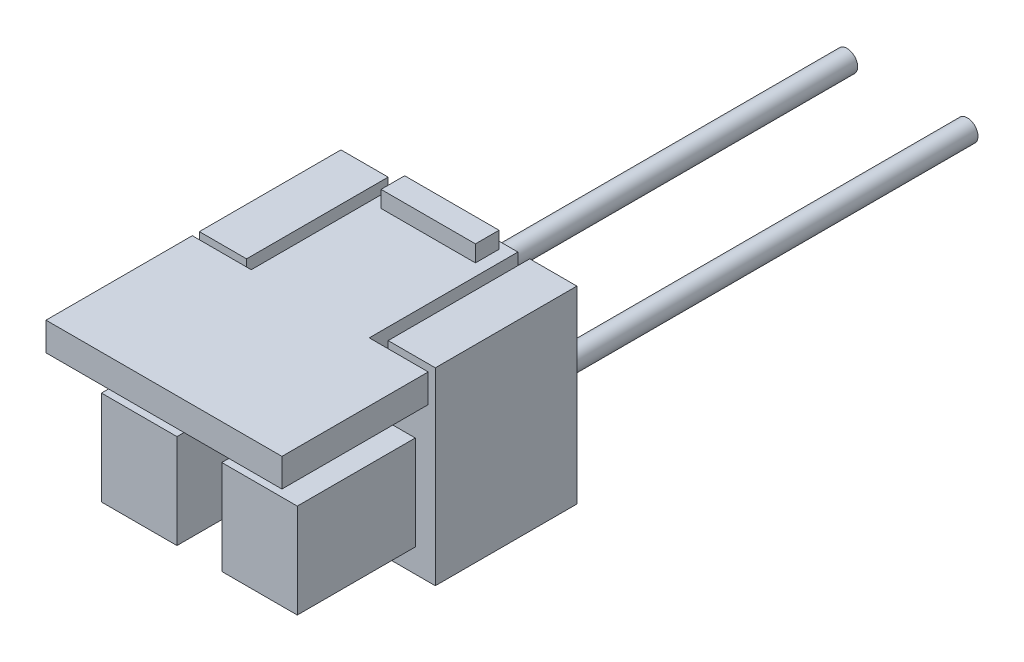
ISO-10303-21;
HEADER;
FILE_DESCRIPTION(('STEP AP214'),'2;1');
FILE_NAME('part.step','',(''),(''),'','','');
FILE_SCHEMA(('AUTOMOTIVE_DESIGN { 1 0 10303 214 1 1 1 1 }'));
ENDSEC;
DATA;
#1=APPLICATION_CONTEXT('core data for automotive mechanical design processes');
#2=APPLICATION_PROTOCOL_DEFINITION('international standard','automotive_design',2000,#1);
#3=PRODUCT_CONTEXT('',#1,'mechanical');
#4=PRODUCT('Part','Part','',(#3));
#5=PRODUCT_RELATED_PRODUCT_CATEGORY('part','',(#4));
#6=PRODUCT_DEFINITION_FORMATION('','',#4);
#7=PRODUCT_DEFINITION_CONTEXT('part definition',#1,'design');
#8=PRODUCT_DEFINITION('design','',#6,#7);
#9=PRODUCT_DEFINITION_SHAPE('','',#8);
#10=(LENGTH_UNIT() NAMED_UNIT(*) SI_UNIT(.MILLI.,.METRE.));
#11=(NAMED_UNIT(*) PLANE_ANGLE_UNIT() SI_UNIT($,.RADIAN.));
#12=(NAMED_UNIT(*) SI_UNIT($,.STERADIAN.) SOLID_ANGLE_UNIT());
#13=UNCERTAINTY_MEASURE_WITH_UNIT(LENGTH_MEASURE(1.E-05),#10,'distance_accuracy_value','');
#14=(GEOMETRIC_REPRESENTATION_CONTEXT(3) GLOBAL_UNCERTAINTY_ASSIGNED_CONTEXT((#13)) GLOBAL_UNIT_ASSIGNED_CONTEXT((#10,
#11,#12)) REPRESENTATION_CONTEXT('',''));
#15=CARTESIAN_POINT('',(0.,0.,0.));
#16=DIRECTION('',(0.,0.,1.));
#17=DIRECTION('',(1.,0.,0.));
#18=AXIS2_PLACEMENT_3D('',#15,#16,#17);
#19=CARTESIAN_POINT('',(5.,5.,-6.));
#20=DIRECTION('',(1.,0.,0.));
#21=DIRECTION('',(0.,0.,-1.));
#22=AXIS2_PLACEMENT_3D('',#19,#20,#21);
#23=PLANE('',#22);
#24=DIRECTION('',(0.,0.,1.));
#25=VECTOR('',#24,1.);
#26=CARTESIAN_POINT('',(5.,5.,-6.));
#27=LINE('',#26,#25);
#28=CARTESIAN_POINT('',(5.,5.,-6.));
#29=VERTEX_POINT('',#28);
#30=CARTESIAN_POINT('',(5.,5.,0.));
#31=VERTEX_POINT('',#30);
#32=EDGE_CURVE('E26',#29,#31,#27,.T.);
#33=ORIENTED_EDGE('',*,*,#32,.T.);
#34=DIRECTION('',(0.,1.,0.));
#35=VECTOR('',#34,1.);
#36=CARTESIAN_POINT('',(5.,5.,0.));
#37=LINE('',#36,#35);
#38=CARTESIAN_POINT('',(5.,-3.,0.));
#39=VERTEX_POINT('',#38);
#40=EDGE_CURVE('E428',#39,#31,#37,.T.);
#41=ORIENTED_EDGE('',*,*,#40,.F.);
#42=DIRECTION('',(0.,0.,1.));
#43=VECTOR('',#42,1.);
#44=CARTESIAN_POINT('',(5.,-3.,-6.));
#45=LINE('',#44,#43);
#46=CARTESIAN_POINT('',(5.,-3.,-6.));
#47=VERTEX_POINT('',#46);
#48=EDGE_CURVE('E11',#47,#39,#45,.T.);
#49=ORIENTED_EDGE('',*,*,#48,.F.);
#50=DIRECTION('',(0.,1.,0.));
#51=VECTOR('',#50,1.);
#52=CARTESIAN_POINT('',(5.,5.,-6.));
#53=LINE('',#52,#51);
#54=EDGE_CURVE('E440',#47,#29,#53,.T.);
#55=ORIENTED_EDGE('',*,*,#54,.T.);
#56=EDGE_LOOP('',(#33,#41,#49,#55));
#57=FACE_BOUND('',#56,.T.);
#58=ADVANCED_FACE('F16',(#57),#23,.T.);
#59=CARTESIAN_POINT('',(0.,5.,-6.));
#60=DIRECTION('',(0.,1.,0.));
#61=DIRECTION('',(0.,0.,1.));
#62=AXIS2_PLACEMENT_3D('',#59,#60,#61);
#63=PLANE('',#62);
#64=DIRECTION('',(0.,0.,-1.));
#65=VECTOR('',#64,1.);
#66=CARTESIAN_POINT('',(3.,5.,-6.));
#67=LINE('',#66,#65);
#68=CARTESIAN_POINT('',(3.,5.,0.));
#69=VERTEX_POINT('',#68);
#70=CARTESIAN_POINT('',(3.,5.,-6.));
#71=VERTEX_POINT('',#70);
#72=EDGE_CURVE('E325',#69,#71,#67,.T.);
#73=ORIENTED_EDGE('',*,*,#72,.F.);
#74=DIRECTION('',(-1.,0.,0.));
#75=VECTOR('',#74,1.);
#76=CARTESIAN_POINT('',(3.,5.,0.));
#77=LINE('',#76,#75);
#78=EDGE_CURVE('E332',#31,#69,#77,.T.);
#79=ORIENTED_EDGE('',*,*,#78,.F.);
#80=ORIENTED_EDGE('',*,*,#32,.F.);
#81=DIRECTION('',(-1.,0.,0.));
#82=VECTOR('',#81,1.);
#83=CARTESIAN_POINT('',(0.,5.,-6.));
#84=LINE('',#83,#82);
#85=EDGE_CURVE('E425',#29,#71,#84,.T.);
#86=ORIENTED_EDGE('',*,*,#85,.T.);
#87=EDGE_LOOP('',(#73,#79,#80,#86));
#88=FACE_BOUND('',#87,.T.);
#89=ADVANCED_FACE('F387',(#88),#63,.T.);
#90=CARTESIAN_POINT('',(5.,-3.,0.));
#91=DIRECTION('',(0.,0.,1.));
#92=DIRECTION('',(1.,0.,0.));
#93=AXIS2_PLACEMENT_3D('',#90,#91,#92);
#94=PLANE('',#93);
#95=DIRECTION('',(1.,0.,0.));
#96=VECTOR('',#95,1.);
#97=CARTESIAN_POINT('',(0.,3.8,0.));
#98=LINE('',#97,#96);
#99=CARTESIAN_POINT('',(-2.5,3.8,0.));
#100=VERTEX_POINT('',#99);
#101=CARTESIAN_POINT('',(2.5,3.8,0.));
#102=VERTEX_POINT('',#101);
#103=EDGE_CURVE('E432',#100,#102,#98,.T.);
#104=ORIENTED_EDGE('',*,*,#103,.F.);
#105=DIRECTION('',(-1.,0.,0.));
#106=VECTOR('',#105,1.);
#107=CARTESIAN_POINT('',(0.,3.8,0.));
#108=LINE('',#107,#106);
#109=CARTESIAN_POINT('',(-3.,3.8,0.));
#110=VERTEX_POINT('',#109);
#111=EDGE_CURVE('E306',#100,#110,#108,.T.);
#112=ORIENTED_EDGE('',*,*,#111,.T.);
#113=DIRECTION('',(0.,1.,0.));
#114=VECTOR('',#113,1.);
#115=CARTESIAN_POINT('',(-3.,-2.97790528113222,0.));
#116=LINE('',#115,#114);
#117=CARTESIAN_POINT('',(-3.,5.,0.));
#118=VERTEX_POINT('',#117);
#119=EDGE_CURVE('E247',#110,#118,#116,.T.);
#120=ORIENTED_EDGE('',*,*,#119,.T.);
#121=DIRECTION('',(1.,0.,0.));
#122=VECTOR('',#121,1.);
#123=CARTESIAN_POINT('',(-3.,5.,0.));
#124=LINE('',#123,#122);
#125=CARTESIAN_POINT('',(-5.,5.,0.));
#126=VERTEX_POINT('',#125);
#127=EDGE_CURVE('E221',#126,#118,#124,.T.);
#128=ORIENTED_EDGE('',*,*,#127,.F.);
#129=DIRECTION('',(0.,1.,0.));
#130=VECTOR('',#129,1.);
#131=CARTESIAN_POINT('',(-5.,5.,0.));
#132=LINE('',#131,#130);
#133=CARTESIAN_POINT('',(-5.,-3.,0.));
#134=VERTEX_POINT('',#133);
#135=EDGE_CURVE('E513',#134,#126,#132,.T.);
#136=ORIENTED_EDGE('',*,*,#135,.F.);
#137=DIRECTION('',(1.,0.,0.));
#138=VECTOR('',#137,1.);
#139=CARTESIAN_POINT('',(0.,-3.,0.));
#140=LINE('',#139,#138);
#141=EDGE_CURVE('E431',#134,#39,#140,.T.);
#142=ORIENTED_EDGE('',*,*,#141,.T.);
#143=ORIENTED_EDGE('',*,*,#40,.T.);
#144=ORIENTED_EDGE('',*,*,#78,.T.);
#145=DIRECTION('',(0.,1.,0.));
#146=VECTOR('',#145,1.);
#147=CARTESIAN_POINT('',(3.,-2.97790528113222,0.));
#148=LINE('',#147,#146);
#149=CARTESIAN_POINT('',(3.,3.8,0.));
#150=VERTEX_POINT('',#149);
#151=EDGE_CURVE('E336',#150,#69,#148,.T.);
#152=ORIENTED_EDGE('',*,*,#151,.F.);
#153=EDGE_CURVE('E20',#102,#150,#98,.T.);
#154=ORIENTED_EDGE('',*,*,#153,.F.);
#155=EDGE_LOOP('',(#104,#112,#120,#128,#136,#142,#143,#144,#152,#154));
#156=FACE_BOUND('',#155,.T.);
#157=DIRECTION('',(1.,0.,0.));
#158=VECTOR('',#157,1.);
#159=CARTESIAN_POINT('',(0.950000000000001,-2.,0.));
#160=LINE('',#159,#158);
#161=CARTESIAN_POINT('',(0.950000000000001,-2.,0.));
#162=VERTEX_POINT('',#161);
#163=CARTESIAN_POINT('',(4.15,-2.,0.));
#164=VERTEX_POINT('',#163);
#165=EDGE_CURVE('E865',#162,#164,#160,.T.);
#166=ORIENTED_EDGE('',*,*,#165,.F.);
#167=DIRECTION('',(0.,-1.,0.));
#168=VECTOR('',#167,1.);
#169=CARTESIAN_POINT('',(0.95,2.,0.));
#170=LINE('',#169,#168);
#171=CARTESIAN_POINT('',(0.95,2.,0.));
#172=VERTEX_POINT('',#171);
#173=EDGE_CURVE('E859',#172,#162,#170,.T.);
#174=ORIENTED_EDGE('',*,*,#173,.F.);
#175=DIRECTION('',(-1.,0.,0.));
#176=VECTOR('',#175,1.);
#177=CARTESIAN_POINT('',(0.95,2.,0.));
#178=LINE('',#177,#176);
#179=CARTESIAN_POINT('',(4.15,2.,0.));
#180=VERTEX_POINT('',#179);
#181=EDGE_CURVE('E870',#180,#172,#178,.T.);
#182=ORIENTED_EDGE('',*,*,#181,.F.);
#183=DIRECTION('',(0.,1.,0.));
#184=VECTOR('',#183,1.);
#185=CARTESIAN_POINT('',(4.15,2.,0.));
#186=LINE('',#185,#184);
#187=EDGE_CURVE('E867',#164,#180,#186,.T.);
#188=ORIENTED_EDGE('',*,*,#187,.F.);
#189=EDGE_LOOP('',(#166,#174,#182,#188));
#190=FACE_BOUND('',#189,.T.);
#191=DIRECTION('',(-1.,0.,0.));
#192=VECTOR('',#191,1.);
#193=CARTESIAN_POINT('',(-0.950000000000001,-2.,0.));
#194=LINE('',#193,#192);
#195=CARTESIAN_POINT('',(-0.950000000000001,-2.,0.));
#196=VERTEX_POINT('',#195);
#197=CARTESIAN_POINT('',(-4.15,-2.,0.));
#198=VERTEX_POINT('',#197);
#199=EDGE_CURVE('E278',#196,#198,#194,.T.);
#200=ORIENTED_EDGE('',*,*,#199,.T.);
#201=DIRECTION('',(0.,1.,0.));
#202=VECTOR('',#201,1.);
#203=CARTESIAN_POINT('',(-4.15,2.,0.));
#204=LINE('',#203,#202);
#205=CARTESIAN_POINT('',(-4.15,2.,0.));
#206=VERTEX_POINT('',#205);
#207=EDGE_CURVE('E281',#198,#206,#204,.T.);
#208=ORIENTED_EDGE('',*,*,#207,.T.);
#209=DIRECTION('',(1.,0.,0.));
#210=VECTOR('',#209,1.);
#211=CARTESIAN_POINT('',(-0.95,2.,0.));
#212=LINE('',#211,#210);
#213=CARTESIAN_POINT('',(-0.95,2.,0.));
#214=VERTEX_POINT('',#213);
#215=EDGE_CURVE('E284',#206,#214,#212,.T.);
#216=ORIENTED_EDGE('',*,*,#215,.T.);
#217=DIRECTION('',(0.,-1.,0.));
#218=VECTOR('',#217,1.);
#219=CARTESIAN_POINT('',(-0.95,2.,0.));
#220=LINE('',#219,#218);
#221=EDGE_CURVE('E275',#214,#196,#220,.T.);
#222=ORIENTED_EDGE('',*,*,#221,.T.);
#223=EDGE_LOOP('',(#200,#208,#216,#222));
#224=FACE_BOUND('',#223,.T.);
#225=ADVANCED_FACE('F392',(#156,#190,#224),#94,.T.);
#226=DIRECTION('',(0.,1.,0.));
#227=VECTOR('',#226,1.);
#228=CARTESIAN_POINT('',(5.,-2.97790528113222,0.300000000000002));
#229=LINE('',#228,#227);
#230=CARTESIAN_POINT('',(5.,3.8,0.300000000000002));
#231=VERTEX_POINT('',#230);
#232=CARTESIAN_POINT('',(5.,5.,0.300000000000002));
#233=VERTEX_POINT('',#232);
#234=EDGE_CURVE('E338',#231,#233,#229,.T.);
#235=ORIENTED_EDGE('',*,*,#234,.T.);
#236=CARTESIAN_POINT('',(4.99999999999999,5.,6.5));
#237=VERTEX_POINT('',#236);
#238=EDGE_CURVE('E410',#233,#237,#27,.T.);
#239=ORIENTED_EDGE('',*,*,#238,.T.);
#240=DIRECTION('',(0.,1.,0.));
#241=VECTOR('',#240,1.);
#242=CARTESIAN_POINT('',(4.99999999999999,3.8,6.5));
#243=LINE('',#242,#241);
#244=CARTESIAN_POINT('',(4.99999999999999,3.8,6.5));
#245=VERTEX_POINT('',#244);
#246=EDGE_CURVE('E477',#245,#237,#243,.T.);
#247=ORIENTED_EDGE('',*,*,#246,.F.);
#248=DIRECTION('',(0.,0.,-1.));
#249=VECTOR('',#248,1.);
#250=CARTESIAN_POINT('',(4.99999999999999,3.8,6.5));
#251=LINE('',#250,#249);
#252=EDGE_CURVE('E413',#245,#231,#251,.T.);
#253=ORIENTED_EDGE('',*,*,#252,.T.);
#254=EDGE_LOOP('',(#235,#239,#247,#253));
#255=FACE_BOUND('',#254,.T.);
#256=ADVANCED_FACE('F18',(#255),#23,.T.);
#257=CARTESIAN_POINT('',(0.,-3.,-6.));
#258=DIRECTION('',(0.,-1.,0.));
#259=DIRECTION('',(0.,0.,-1.));
#260=AXIS2_PLACEMENT_3D('',#257,#258,#259);
#261=PLANE('',#260);
#262=ORIENTED_EDGE('',*,*,#141,.F.);
#263=DIRECTION('',(0.,0.,1.));
#264=VECTOR('',#263,1.);
#265=CARTESIAN_POINT('',(-5.,-3.,-6.));
#266=LINE('',#265,#264);
#267=CARTESIAN_POINT('',(-5.,-3.,-6.));
#268=VERTEX_POINT('',#267);
#269=EDGE_CURVE('E328',#268,#134,#266,.T.);
#270=ORIENTED_EDGE('',*,*,#269,.F.);
#271=DIRECTION('',(1.,0.,0.));
#272=VECTOR('',#271,1.);
#273=CARTESIAN_POINT('',(0.,-3.,-6.));
#274=LINE('',#273,#272);
#275=EDGE_CURVE('E422',#268,#47,#274,.T.);
#276=ORIENTED_EDGE('',*,*,#275,.T.);
#277=ORIENTED_EDGE('',*,*,#48,.T.);
#278=EDGE_LOOP('',(#262,#270,#276,#277));
#279=FACE_BOUND('',#278,.T.);
#280=ADVANCED_FACE('F397',(#279),#261,.T.);
#281=DIRECTION('',(0.,0.,1.));
#282=VECTOR('',#281,1.);
#283=CARTESIAN_POINT('',(-5.,5.,-6.00000000000001));
#284=LINE('',#283,#282);
#285=CARTESIAN_POINT('',(-5.,5.,0.300000000000002));
#286=VERTEX_POINT('',#285);
#287=CARTESIAN_POINT('',(-5.00000000000001,5.,6.5));
#288=VERTEX_POINT('',#287);
#289=EDGE_CURVE('E233',#286,#288,#284,.T.);
#290=ORIENTED_EDGE('',*,*,#289,.T.);
#291=DIRECTION('',(-1.,0.,0.));
#292=VECTOR('',#291,1.);
#293=CARTESIAN_POINT('',(4.99999999999999,5.,6.5));
#294=LINE('',#293,#292);
#295=EDGE_CURVE('E420',#237,#288,#294,.T.);
#296=ORIENTED_EDGE('',*,*,#295,.F.);
#297=ORIENTED_EDGE('',*,*,#238,.F.);
#298=DIRECTION('',(1.,0.,0.));
#299=VECTOR('',#298,1.);
#300=CARTESIAN_POINT('',(5.,5.,0.300000000000002));
#301=LINE('',#300,#299);
#302=CARTESIAN_POINT('',(2.5,5.,0.300000000000002));
#303=VERTEX_POINT('',#302);
#304=EDGE_CURVE('E330',#303,#233,#301,.T.);
#305=ORIENTED_EDGE('',*,*,#304,.F.);
#306=DIRECTION('',(0.,0.,1.));
#307=VECTOR('',#306,1.);
#308=CARTESIAN_POINT('',(2.5,5.,0.300000000000002));
#309=LINE('',#308,#307);
#310=CARTESIAN_POINT('',(2.5,5.,-6.));
#311=VERTEX_POINT('',#310);
#312=EDGE_CURVE('E327',#311,#303,#309,.T.);
#313=ORIENTED_EDGE('',*,*,#312,.F.);
#314=CARTESIAN_POINT('',(-2.5,5.,-6.));
#315=VERTEX_POINT('',#314);
#316=EDGE_CURVE('E443',#311,#315,#84,.T.);
#317=ORIENTED_EDGE('',*,*,#316,.T.);
#318=DIRECTION('',(0.,0.,1.));
#319=VECTOR('',#318,1.);
#320=CARTESIAN_POINT('',(-2.5,5.,0.300000000000002));
#321=LINE('',#320,#319);
#322=CARTESIAN_POINT('',(-2.5,5.,0.300000000000002));
#323=VERTEX_POINT('',#322);
#324=EDGE_CURVE('E237',#315,#323,#321,.T.);
#325=ORIENTED_EDGE('',*,*,#324,.T.);
#326=DIRECTION('',(-1.,0.,0.));
#327=VECTOR('',#326,1.);
#328=CARTESIAN_POINT('',(-5.,5.,0.300000000000002));
#329=LINE('',#328,#327);
#330=EDGE_CURVE('E240',#323,#286,#329,.T.);
#331=ORIENTED_EDGE('',*,*,#330,.T.);
#332=EDGE_LOOP('',(#290,#296,#297,#305,#313,#317,#325,#331));
#333=FACE_BOUND('',#332,.T.);
#334=DIRECTION('',(1.,0.,0.));
#335=VECTOR('',#334,1.);
#336=CARTESIAN_POINT('',(2.,5.,-4.7));
#337=LINE('',#336,#335);
#338=CARTESIAN_POINT('',(-2.,5.,-4.7));
#339=VERTEX_POINT('',#338);
#340=CARTESIAN_POINT('',(2.,5.,-4.7));
#341=VERTEX_POINT('',#340);
#342=EDGE_CURVE('E360',#339,#341,#337,.T.);
#343=ORIENTED_EDGE('',*,*,#342,.F.);
#344=DIRECTION('',(0.,0.,-1.));
#345=VECTOR('',#344,1.);
#346=CARTESIAN_POINT('',(-2.,5.,-5.7));
#347=LINE('',#346,#345);
#348=CARTESIAN_POINT('',(-2.,5.,-5.7));
#349=VERTEX_POINT('',#348);
#350=EDGE_CURVE('E263',#339,#349,#347,.T.);
#351=ORIENTED_EDGE('',*,*,#350,.T.);
#352=DIRECTION('',(-1.,0.,0.));
#353=VECTOR('',#352,1.);
#354=CARTESIAN_POINT('',(0.,5.,-5.7));
#355=LINE('',#354,#353);
#356=CARTESIAN_POINT('',(2.,5.,-5.7));
#357=VERTEX_POINT('',#356);
#358=EDGE_CURVE('E352',#357,#349,#355,.T.);
#359=ORIENTED_EDGE('',*,*,#358,.F.);
#360=DIRECTION('',(0.,0.,-1.));
#361=VECTOR('',#360,1.);
#362=CARTESIAN_POINT('',(2.,5.,-5.7));
#363=LINE('',#362,#361);
#364=EDGE_CURVE('E42',#341,#357,#363,.T.);
#365=ORIENTED_EDGE('',*,*,#364,.F.);
#366=EDGE_LOOP('',(#343,#351,#359,#365));
#367=FACE_BOUND('',#366,.T.);
#368=ADVANCED_FACE('F394',(#333,#367),#63,.T.);
#369=CARTESIAN_POINT('',(5.,-3.,-6.));
#370=DIRECTION('',(0.,0.,1.));
#371=DIRECTION('',(1.,0.,0.));
#372=AXIS2_PLACEMENT_3D('',#369,#370,#371);
#373=PLANE('',#372);
#374=CARTESIAN_POINT('',(2.55,0.,-6.));
#375=DIRECTION('',(0.,0.,1.));
#376=DIRECTION('',(1.,0.,0.));
#377=AXIS2_PLACEMENT_3D('',#374,#375,#376);
#378=CIRCLE('',#377,0.45);
#379=CARTESIAN_POINT('',(3.,0.,-6.));
#380=VERTEX_POINT('',#379);
#381=EDGE_CURVE('E350',#380,#380,#378,.T.);
#382=ORIENTED_EDGE('',*,*,#381,.T.);
#383=EDGE_LOOP('',(#382));
#384=FACE_BOUND('',#383,.T.);
#385=DIRECTION('',(1.,0.,0.));
#386=VECTOR('',#385,1.);
#387=CARTESIAN_POINT('',(3.,3.8,-6.));
#388=LINE('',#387,#386);
#389=CARTESIAN_POINT('',(2.5,3.8,-6.));
#390=VERTEX_POINT('',#389);
#391=CARTESIAN_POINT('',(3.,3.8,-6.));
#392=VERTEX_POINT('',#391);
#393=EDGE_CURVE('E324',#390,#392,#388,.T.);
#394=ORIENTED_EDGE('',*,*,#393,.T.);
#395=DIRECTION('',(0.,1.,0.));
#396=VECTOR('',#395,1.);
#397=CARTESIAN_POINT('',(3.,-2.97790528113222,-6.));
#398=LINE('',#397,#396);
#399=EDGE_CURVE('E335',#392,#71,#398,.T.);
#400=ORIENTED_EDGE('',*,*,#399,.T.);
#401=ORIENTED_EDGE('',*,*,#85,.F.);
#402=ORIENTED_EDGE('',*,*,#54,.F.);
#403=ORIENTED_EDGE('',*,*,#275,.F.);
#404=DIRECTION('',(0.,1.,0.));
#405=VECTOR('',#404,1.);
#406=CARTESIAN_POINT('',(-5.,5.,-6.00000000000001));
#407=LINE('',#406,#405);
#408=CARTESIAN_POINT('',(-5.,5.,-6.00000000000001));
#409=VERTEX_POINT('',#408);
#410=EDGE_CURVE('E229',#268,#409,#407,.T.);
#411=ORIENTED_EDGE('',*,*,#410,.T.);
#412=DIRECTION('',(1.,0.,0.));
#413=VECTOR('',#412,1.);
#414=CARTESIAN_POINT('',(0.,5.,-6.));
#415=LINE('',#414,#413);
#416=CARTESIAN_POINT('',(-3.,5.,-6.));
#417=VERTEX_POINT('',#416);
#418=EDGE_CURVE('E224',#409,#417,#415,.T.);
#419=ORIENTED_EDGE('',*,*,#418,.T.);
#420=DIRECTION('',(0.,1.,0.));
#421=VECTOR('',#420,1.);
#422=CARTESIAN_POINT('',(-3.,-2.97790528113222,-6.));
#423=LINE('',#422,#421);
#424=CARTESIAN_POINT('',(-3.,3.8,-6.));
#425=VERTEX_POINT('',#424);
#426=EDGE_CURVE('E210',#425,#417,#423,.T.);
#427=ORIENTED_EDGE('',*,*,#426,.F.);
#428=DIRECTION('',(-1.,0.,0.));
#429=VECTOR('',#428,1.);
#430=CARTESIAN_POINT('',(-3.,3.8,-6.));
#431=LINE('',#430,#429);
#432=CARTESIAN_POINT('',(-2.5,3.8,-6.));
#433=VERTEX_POINT('',#432);
#434=EDGE_CURVE('E257',#433,#425,#431,.T.);
#435=ORIENTED_EDGE('',*,*,#434,.F.);
#436=DIRECTION('',(0.,1.,0.));
#437=VECTOR('',#436,1.);
#438=CARTESIAN_POINT('',(-2.5,-2.97790528113222,-6.));
#439=LINE('',#438,#437);
#440=EDGE_CURVE('E220',#433,#315,#439,.T.);
#441=ORIENTED_EDGE('',*,*,#440,.T.);
#442=ORIENTED_EDGE('',*,*,#316,.F.);
#443=DIRECTION('',(0.,1.,0.));
#444=VECTOR('',#443,1.);
#445=CARTESIAN_POINT('',(2.5,-2.97790528113222,-6.));
#446=LINE('',#445,#444);
#447=EDGE_CURVE('E342',#390,#311,#446,.T.);
#448=ORIENTED_EDGE('',*,*,#447,.F.);
#449=EDGE_LOOP('',(#394,#400,#401,#402,#403,#411,#419,#427,#435,#441,#442,#448));
#450=FACE_BOUND('',#449,.T.);
#451=CARTESIAN_POINT('',(-2.55,0.,-6.));
#452=DIRECTION('',(0.,0.,-1.));
#453=DIRECTION('',(-1.,0.,0.));
#454=AXIS2_PLACEMENT_3D('',#451,#452,#453);
#455=CIRCLE('',#454,0.45);
#456=CARTESIAN_POINT('',(-3.,0.,-6.));
#457=VERTEX_POINT('',#456);
#458=EDGE_CURVE('E262',#457,#457,#455,.T.);
#459=ORIENTED_EDGE('',*,*,#458,.F.);
#460=EDGE_LOOP('',(#459));
#461=FACE_BOUND('',#460,.T.);
#462=ADVANCED_FACE('F226',(#384,#450,#461),#373,.F.);
#463=CARTESIAN_POINT('',(0.,3.8,6.5));
#464=DIRECTION('',(0.,1.,0.));
#465=DIRECTION('',(0.,0.,1.));
#466=AXIS2_PLACEMENT_3D('',#463,#464,#465);
#467=PLANE('',#466);
#468=DIRECTION('',(0.,0.,-1.));
#469=VECTOR('',#468,1.);
#470=CARTESIAN_POINT('',(2.5,3.8,0.300000000000002));
#471=LINE('',#470,#469);
#472=CARTESIAN_POINT('',(2.5,3.8,0.300000000000002));
#473=VERTEX_POINT('',#472);
#474=EDGE_CURVE('E316',#473,#102,#471,.T.);
#475=ORIENTED_EDGE('',*,*,#474,.F.);
#476=DIRECTION('',(-1.,0.,0.));
#477=VECTOR('',#476,1.);
#478=CARTESIAN_POINT('',(5.,3.8,0.300000000000002));
#479=LINE('',#478,#477);
#480=EDGE_CURVE('E318',#231,#473,#479,.T.);
#481=ORIENTED_EDGE('',*,*,#480,.F.);
#482=ORIENTED_EDGE('',*,*,#252,.F.);
#483=DIRECTION('',(1.,0.,0.));
#484=VECTOR('',#483,1.);
#485=CARTESIAN_POINT('',(0.,3.8,6.5));
#486=LINE('',#485,#484);
#487=CARTESIAN_POINT('',(-5.00000000000001,3.8,6.5));
#488=VERTEX_POINT('',#487);
#489=EDGE_CURVE('E436',#488,#245,#486,.T.);
#490=ORIENTED_EDGE('',*,*,#489,.F.);
#491=DIRECTION('',(0.,0.,-1.));
#492=VECTOR('',#491,1.);
#493=CARTESIAN_POINT('',(-5.00000000000001,3.8,6.5));
#494=LINE('',#493,#492);
#495=CARTESIAN_POINT('',(-5.,3.8,0.300000000000002));
#496=VERTEX_POINT('',#495);
#497=EDGE_CURVE('E469',#488,#496,#494,.T.);
#498=ORIENTED_EDGE('',*,*,#497,.T.);
#499=DIRECTION('',(1.,0.,0.));
#500=VECTOR('',#499,1.);
#501=CARTESIAN_POINT('',(-5.,3.8,0.300000000000002));
#502=LINE('',#501,#500);
#503=CARTESIAN_POINT('',(-2.5,3.8,0.300000000000002));
#504=VERTEX_POINT('',#503);
#505=EDGE_CURVE('E461',#496,#504,#502,.T.);
#506=ORIENTED_EDGE('',*,*,#505,.T.);
#507=DIRECTION('',(0.,0.,-1.));
#508=VECTOR('',#507,1.);
#509=CARTESIAN_POINT('',(-2.5,3.8,0.300000000000002));
#510=LINE('',#509,#508);
#511=EDGE_CURVE('E457',#504,#100,#510,.T.);
#512=ORIENTED_EDGE('',*,*,#511,.T.);
#513=ORIENTED_EDGE('',*,*,#103,.T.);
#514=EDGE_LOOP('',(#475,#481,#482,#490,#498,#506,#512,#513));
#515=FACE_BOUND('',#514,.T.);
#516=ADVANCED_FACE('F465',(#515),#467,.F.);
#517=CARTESIAN_POINT('',(4.99999999999999,5.,6.5));
#518=DIRECTION('',(0.,0.,1.));
#519=DIRECTION('',(1.,0.,0.));
#520=AXIS2_PLACEMENT_3D('',#517,#518,#519);
#521=PLANE('',#520);
#522=ORIENTED_EDGE('',*,*,#246,.T.);
#523=ORIENTED_EDGE('',*,*,#295,.T.);
#524=DIRECTION('',(0.,1.,0.));
#525=VECTOR('',#524,1.);
#526=CARTESIAN_POINT('',(-5.00000000000001,3.8,6.5));
#527=LINE('',#526,#525);
#528=EDGE_CURVE('E309',#488,#288,#527,.T.);
#529=ORIENTED_EDGE('',*,*,#528,.F.);
#530=ORIENTED_EDGE('',*,*,#489,.T.);
#531=EDGE_LOOP('',(#522,#523,#529,#530));
#532=FACE_BOUND('',#531,.T.);
#533=ADVANCED_FACE('F494',(#532),#521,.T.);
#534=CARTESIAN_POINT('',(0.95,2.,5.));
#535=DIRECTION('',(1.,0.,0.));
#536=DIRECTION('',(0.,1.,0.));
#537=AXIS2_PLACEMENT_3D('',#534,#535,#536);
#538=PLANE('',#537);
#539=ORIENTED_EDGE('',*,*,#173,.T.);
#540=DIRECTION('',(0.,0.,-1.));
#541=VECTOR('',#540,1.);
#542=CARTESIAN_POINT('',(0.950000000000001,-2.,5.));
#543=LINE('',#542,#541);
#544=CARTESIAN_POINT('',(0.950000000000001,-2.,5.));
#545=VERTEX_POINT('',#544);
#546=EDGE_CURVE('E479',#545,#162,#543,.T.);
#547=ORIENTED_EDGE('',*,*,#546,.F.);
#548=DIRECTION('',(0.,-1.,0.));
#549=VECTOR('',#548,1.);
#550=CARTESIAN_POINT('',(0.95,2.,5.));
#551=LINE('',#550,#549);
#552=CARTESIAN_POINT('',(0.95,2.,5.));
#553=VERTEX_POINT('',#552);
#554=EDGE_CURVE('E872',#553,#545,#551,.T.);
#555=ORIENTED_EDGE('',*,*,#554,.F.);
#556=DIRECTION('',(0.,0.,-1.));
#557=VECTOR('',#556,1.);
#558=CARTESIAN_POINT('',(0.95,2.,5.));
#559=LINE('',#558,#557);
#560=EDGE_CURVE('E881',#553,#172,#559,.T.);
#561=ORIENTED_EDGE('',*,*,#560,.T.);
#562=EDGE_LOOP('',(#539,#547,#555,#561));
#563=FACE_BOUND('',#562,.T.);
#564=ADVANCED_FACE('F723',(#563),#538,.F.);
#565=CARTESIAN_POINT('',(0.950000000000001,-2.,5.));
#566=DIRECTION('',(0.,1.,0.));
#567=DIRECTION('',(-1.,0.,0.));
#568=AXIS2_PLACEMENT_3D('',#565,#566,#567);
#569=PLANE('',#568);
#570=ORIENTED_EDGE('',*,*,#165,.T.);
#571=DIRECTION('',(0.,0.,-1.));
#572=VECTOR('',#571,1.);
#573=CARTESIAN_POINT('',(4.15,-2.,5.));
#574=LINE('',#573,#572);
#575=CARTESIAN_POINT('',(4.15,-2.,5.));
#576=VERTEX_POINT('',#575);
#577=EDGE_CURVE('E481',#576,#164,#574,.T.);
#578=ORIENTED_EDGE('',*,*,#577,.F.);
#579=DIRECTION('',(1.,0.,0.));
#580=VECTOR('',#579,1.);
#581=CARTESIAN_POINT('',(0.950000000000001,-2.,5.));
#582=LINE('',#581,#580);
#583=EDGE_CURVE('E875',#545,#576,#582,.T.);
#584=ORIENTED_EDGE('',*,*,#583,.F.);
#585=ORIENTED_EDGE('',*,*,#546,.T.);
#586=EDGE_LOOP('',(#570,#578,#584,#585));
#587=FACE_BOUND('',#586,.T.);
#588=ADVANCED_FACE('F731',(#587),#569,.F.);
#589=CARTESIAN_POINT('',(4.15,2.,5.));
#590=DIRECTION('',(-1.,0.,0.));
#591=DIRECTION('',(0.,-1.,0.));
#592=AXIS2_PLACEMENT_3D('',#589,#590,#591);
#593=PLANE('',#592);
#594=ORIENTED_EDGE('',*,*,#187,.T.);
#595=DIRECTION('',(0.,0.,-1.));
#596=VECTOR('',#595,1.);
#597=CARTESIAN_POINT('',(4.15,2.,5.));
#598=LINE('',#597,#596);
#599=CARTESIAN_POINT('',(4.15,2.,5.));
#600=VERTEX_POINT('',#599);
#601=EDGE_CURVE('E487',#600,#180,#598,.T.);
#602=ORIENTED_EDGE('',*,*,#601,.F.);
#603=DIRECTION('',(0.,1.,0.));
#604=VECTOR('',#603,1.);
#605=CARTESIAN_POINT('',(4.15,2.,5.));
#606=LINE('',#605,#604);
#607=EDGE_CURVE('E877',#576,#600,#606,.T.);
#608=ORIENTED_EDGE('',*,*,#607,.F.);
#609=ORIENTED_EDGE('',*,*,#577,.T.);
#610=EDGE_LOOP('',(#594,#602,#608,#609));
#611=FACE_BOUND('',#610,.T.);
#612=ADVANCED_FACE('F740',(#611),#593,.F.);
#613=CARTESIAN_POINT('',(0.95,2.,5.));
#614=DIRECTION('',(0.,-1.,0.));
#615=DIRECTION('',(0.,0.,-1.));
#616=AXIS2_PLACEMENT_3D('',#613,#614,#615);
#617=PLANE('',#616);
#618=ORIENTED_EDGE('',*,*,#181,.T.);
#619=ORIENTED_EDGE('',*,*,#560,.F.);
#620=DIRECTION('',(-1.,0.,0.));
#621=VECTOR('',#620,1.);
#622=CARTESIAN_POINT('',(0.95,2.,5.));
#623=LINE('',#622,#621);
#624=EDGE_CURVE('E879',#600,#553,#623,.T.);
#625=ORIENTED_EDGE('',*,*,#624,.F.);
#626=ORIENTED_EDGE('',*,*,#601,.T.);
#627=EDGE_LOOP('',(#618,#619,#625,#626));
#628=FACE_BOUND('',#627,.T.);
#629=ADVANCED_FACE('F748',(#628),#617,.F.);
#630=CARTESIAN_POINT('',(0.95,2.,5.));
#631=DIRECTION('',(0.,0.,1.));
#632=DIRECTION('',(1.,0.,0.));
#633=AXIS2_PLACEMENT_3D('',#630,#631,#632);
#634=PLANE('',#633);
#635=ORIENTED_EDGE('',*,*,#554,.T.);
#636=ORIENTED_EDGE('',*,*,#583,.T.);
#637=ORIENTED_EDGE('',*,*,#607,.T.);
#638=ORIENTED_EDGE('',*,*,#624,.T.);
#639=EDGE_LOOP('',(#635,#636,#637,#638));
#640=FACE_BOUND('',#639,.T.);
#641=ADVANCED_FACE('F757',(#640),#634,.T.);
#642=CARTESIAN_POINT('',(2.,5.7,-5.7));
#643=DIRECTION('',(-1.,0.,0.));
#644=DIRECTION('',(0.,0.,1.));
#645=AXIS2_PLACEMENT_3D('',#642,#643,#644);
#646=PLANE('',#645);
#647=ORIENTED_EDGE('',*,*,#364,.T.);
#648=DIRECTION('',(0.,-1.,0.));
#649=VECTOR('',#648,1.);
#650=CARTESIAN_POINT('',(2.,5.7,-5.7));
#651=LINE('',#650,#649);
#652=CARTESIAN_POINT('',(2.,5.7,-5.7));
#653=VERTEX_POINT('',#652);
#654=EDGE_CURVE('E855',#653,#357,#651,.T.);
#655=ORIENTED_EDGE('',*,*,#654,.F.);
#656=DIRECTION('',(0.,0.,-1.));
#657=VECTOR('',#656,1.);
#658=CARTESIAN_POINT('',(2.,5.7,-5.7));
#659=LINE('',#658,#657);
#660=CARTESIAN_POINT('',(2.,5.7,-4.7));
#661=VERTEX_POINT('',#660);
#662=EDGE_CURVE('E355',#661,#653,#659,.T.);
#663=ORIENTED_EDGE('',*,*,#662,.F.);
#664=DIRECTION('',(0.,-1.,0.));
#665=VECTOR('',#664,1.);
#666=CARTESIAN_POINT('',(2.,5.7,-4.7));
#667=LINE('',#666,#665);
#668=EDGE_CURVE('E849',#661,#341,#667,.T.);
#669=ORIENTED_EDGE('',*,*,#668,.T.);
#670=EDGE_LOOP('',(#647,#655,#663,#669));
#671=FACE_BOUND('',#670,.T.);
#672=ADVANCED_FACE('F766',(#671),#646,.F.);
#673=CARTESIAN_POINT('',(0.,5.7,-5.7));
#674=DIRECTION('',(0.,0.,1.));
#675=DIRECTION('',(1.,0.,0.));
#676=AXIS2_PLACEMENT_3D('',#673,#674,#675);
#677=PLANE('',#676);
#678=ORIENTED_EDGE('',*,*,#358,.T.);
#679=DIRECTION('',(0.,-1.,0.));
#680=VECTOR('',#679,1.);
#681=CARTESIAN_POINT('',(-2.,5.7,-5.7));
#682=LINE('',#681,#680);
#683=CARTESIAN_POINT('',(-2.,5.7,-5.7));
#684=VERTEX_POINT('',#683);
#685=EDGE_CURVE('E272',#684,#349,#682,.T.);
#686=ORIENTED_EDGE('',*,*,#685,.F.);
#687=DIRECTION('',(-1.,0.,0.));
#688=VECTOR('',#687,1.);
#689=CARTESIAN_POINT('',(0.,5.7,-5.7));
#690=LINE('',#689,#688);
#691=EDGE_CURVE('E861',#653,#684,#690,.T.);
#692=ORIENTED_EDGE('',*,*,#691,.F.);
#693=ORIENTED_EDGE('',*,*,#654,.T.);
#694=EDGE_LOOP('',(#678,#686,#692,#693));
#695=FACE_BOUND('',#694,.T.);
#696=ADVANCED_FACE('F775',(#695),#677,.F.);
#697=CARTESIAN_POINT('',(2.,5.7,-4.7));
#698=DIRECTION('',(0.,0.,-1.));
#699=DIRECTION('',(-1.,0.,0.));
#700=AXIS2_PLACEMENT_3D('',#697,#698,#699);
#701=PLANE('',#700);
#702=ORIENTED_EDGE('',*,*,#342,.T.);
#703=ORIENTED_EDGE('',*,*,#668,.F.);
#704=DIRECTION('',(1.,0.,0.));
#705=VECTOR('',#704,1.);
#706=CARTESIAN_POINT('',(2.,5.7,-4.7));
#707=LINE('',#706,#705);
#708=CARTESIAN_POINT('',(-2.,5.7,-4.7));
#709=VERTEX_POINT('',#708);
#710=EDGE_CURVE('E856',#709,#661,#707,.T.);
#711=ORIENTED_EDGE('',*,*,#710,.F.);
#712=DIRECTION('',(0.,-1.,0.));
#713=VECTOR('',#712,1.);
#714=CARTESIAN_POINT('',(-2.,5.7,-4.7));
#715=LINE('',#714,#713);
#716=EDGE_CURVE('E269',#709,#339,#715,.T.);
#717=ORIENTED_EDGE('',*,*,#716,.T.);
#718=EDGE_LOOP('',(#702,#703,#711,#717));
#719=FACE_BOUND('',#718,.T.);
#720=ADVANCED_FACE('F383',(#719),#701,.F.);
#721=CARTESIAN_POINT('',(2.,5.7,-4.7));
#722=DIRECTION('',(0.,-1.,0.));
#723=DIRECTION('',(0.,0.,-1.));
#724=AXIS2_PLACEMENT_3D('',#721,#722,#723);
#725=PLANE('',#724);
#726=ORIENTED_EDGE('',*,*,#662,.T.);
#727=ORIENTED_EDGE('',*,*,#691,.T.);
#728=DIRECTION('',(0.,0.,-1.));
#729=VECTOR('',#728,1.);
#730=CARTESIAN_POINT('',(-2.,5.7,-5.7));
#731=LINE('',#730,#729);
#732=EDGE_CURVE('E266',#709,#684,#731,.T.);
#733=ORIENTED_EDGE('',*,*,#732,.F.);
#734=ORIENTED_EDGE('',*,*,#710,.T.);
#735=EDGE_LOOP('',(#726,#727,#733,#734));
#736=FACE_BOUND('',#735,.T.);
#737=ADVANCED_FACE('F372',(#736),#725,.F.);
#738=CARTESIAN_POINT('',(2.55,0.,-25.));
#739=DIRECTION('',(0.,0.,1.));
#740=DIRECTION('',(1.,0.,0.));
#741=AXIS2_PLACEMENT_3D('',#738,#739,#740);
#742=CYLINDRICAL_SURFACE('',#741,0.45);
#743=CARTESIAN_POINT('',(2.55,0.,-25.));
#744=DIRECTION('',(0.,0.,1.));
#745=DIRECTION('',(-1.,0.,0.));
#746=AXIS2_PLACEMENT_3D('',#743,#744,#745);
#747=CIRCLE('',#746,0.45);
#748=CARTESIAN_POINT('',(2.1,0.,-25.));
#749=VERTEX_POINT('',#748);
#750=EDGE_CURVE('E347',#749,#749,#747,.T.);
#751=ORIENTED_EDGE('',*,*,#750,.T.);
#752=EDGE_LOOP('',(#751));
#753=FACE_BOUND('',#752,.T.);
#754=ORIENTED_EDGE('',*,*,#381,.F.);
#755=EDGE_LOOP('',(#754));
#756=FACE_BOUND('',#755,.T.);
#757=ADVANCED_FACE('F369',(#753,#756),#742,.T.);
#758=CARTESIAN_POINT('',(2.55,0.,-25.));
#759=DIRECTION('',(0.,0.,-1.));
#760=DIRECTION('',(-1.,0.,0.));
#761=AXIS2_PLACEMENT_3D('',#758,#759,#760);
#762=PLANE('',#761);
#763=ORIENTED_EDGE('',*,*,#750,.F.);
#764=EDGE_LOOP('',(#763));
#765=FACE_BOUND('',#764,.T.);
#766=ADVANCED_FACE('F371',(#765),#762,.T.);
#767=CARTESIAN_POINT('',(3.,-2.97790528113222,-6.));
#768=DIRECTION('',(1.,0.,0.));
#769=DIRECTION('',(0.,0.,-1.));
#770=AXIS2_PLACEMENT_3D('',#767,#768,#769);
#771=PLANE('',#770);
#772=DIRECTION('',(0.,0.,1.));
#773=VECTOR('',#772,1.);
#774=CARTESIAN_POINT('',(3.,3.8,-6.));
#775=LINE('',#774,#773);
#776=EDGE_CURVE('E321',#392,#150,#775,.T.);
#777=ORIENTED_EDGE('',*,*,#776,.T.);
#778=ORIENTED_EDGE('',*,*,#151,.T.);
#779=ORIENTED_EDGE('',*,*,#72,.T.);
#780=ORIENTED_EDGE('',*,*,#399,.F.);
#781=EDGE_LOOP('',(#777,#778,#779,#780));
#782=FACE_BOUND('',#781,.T.);
#783=ADVANCED_FACE('F380',(#782),#771,.F.);
#784=CARTESIAN_POINT('',(5.,-2.97790528113222,0.300000000000002));
#785=DIRECTION('',(0.,0.,1.));
#786=DIRECTION('',(1.,0.,0.));
#787=AXIS2_PLACEMENT_3D('',#784,#785,#786);
#788=PLANE('',#787);
#789=ORIENTED_EDGE('',*,*,#480,.T.);
#790=DIRECTION('',(0.,1.,0.));
#791=VECTOR('',#790,1.);
#792=CARTESIAN_POINT('',(2.5,-2.97790528113222,0.300000000000002));
#793=LINE('',#792,#791);
#794=EDGE_CURVE('E34',#473,#303,#793,.T.);
#795=ORIENTED_EDGE('',*,*,#794,.T.);
#796=ORIENTED_EDGE('',*,*,#304,.T.);
#797=ORIENTED_EDGE('',*,*,#234,.F.);
#798=EDGE_LOOP('',(#789,#795,#796,#797));
#799=FACE_BOUND('',#798,.T.);
#800=ADVANCED_FACE('F496',(#799),#788,.F.);
#801=CARTESIAN_POINT('',(2.5,-2.97790528113222,0.300000000000002));
#802=DIRECTION('',(-1.,0.,0.));
#803=DIRECTION('',(0.,0.,1.));
#804=AXIS2_PLACEMENT_3D('',#801,#802,#803);
#805=PLANE('',#804);
#806=ORIENTED_EDGE('',*,*,#474,.T.);
#807=EDGE_CURVE('E319',#102,#390,#471,.T.);
#808=ORIENTED_EDGE('',*,*,#807,.T.);
#809=ORIENTED_EDGE('',*,*,#447,.T.);
#810=ORIENTED_EDGE('',*,*,#312,.T.);
#811=ORIENTED_EDGE('',*,*,#794,.F.);
#812=EDGE_LOOP('',(#806,#808,#809,#810,#811));
#813=FACE_BOUND('',#812,.T.);
#814=ADVANCED_FACE('F497',(#813),#805,.F.);
#815=CARTESIAN_POINT('',(0.,3.8,6.5));
#816=DIRECTION('',(0.,1.,0.));
#817=DIRECTION('',(0.,0.,1.));
#818=AXIS2_PLACEMENT_3D('',#815,#816,#817);
#819=PLANE('',#818);
#820=ORIENTED_EDGE('',*,*,#776,.F.);
#821=ORIENTED_EDGE('',*,*,#393,.F.);
#822=ORIENTED_EDGE('',*,*,#807,.F.);
#823=ORIENTED_EDGE('',*,*,#153,.T.);
#824=EDGE_LOOP('',(#820,#821,#822,#823));
#825=FACE_BOUND('',#824,.T.);
#826=ADVANCED_FACE('F500',(#825),#819,.T.);
#827=CARTESIAN_POINT('',(-5.,5.,-6.00000000000001));
#828=DIRECTION('',(-1.,0.,0.));
#829=DIRECTION('',(0.,0.,-1.));
#830=AXIS2_PLACEMENT_3D('',#827,#828,#829);
#831=PLANE('',#830);
#832=EDGE_CURVE('E510',#409,#126,#284,.T.);
#833=ORIENTED_EDGE('',*,*,#832,.F.);
#834=ORIENTED_EDGE('',*,*,#410,.F.);
#835=ORIENTED_EDGE('',*,*,#269,.T.);
#836=ORIENTED_EDGE('',*,*,#135,.T.);
#837=EDGE_LOOP('',(#833,#834,#835,#836));
#838=FACE_BOUND('',#837,.T.);
#839=ADVANCED_FACE('F512',(#838),#831,.T.);
#840=DIRECTION('',(0.,0.,-1.));
#841=VECTOR('',#840,1.);
#842=CARTESIAN_POINT('',(-3.,5.,-6.));
#843=LINE('',#842,#841);
#844=EDGE_CURVE('E215',#118,#417,#843,.T.);
#845=ORIENTED_EDGE('',*,*,#844,.T.);
#846=ORIENTED_EDGE('',*,*,#418,.F.);
#847=ORIENTED_EDGE('',*,*,#832,.T.);
#848=ORIENTED_EDGE('',*,*,#127,.T.);
#849=EDGE_LOOP('',(#845,#846,#847,#848));
#850=FACE_BOUND('',#849,.T.);
#851=ADVANCED_FACE('F236',(#850),#63,.T.);
#852=DIRECTION('',(0.,1.,0.));
#853=VECTOR('',#852,1.);
#854=CARTESIAN_POINT('',(-5.,-2.97790528113222,0.300000000000002));
#855=LINE('',#854,#853);
#856=EDGE_CURVE('E250',#496,#286,#855,.T.);
#857=ORIENTED_EDGE('',*,*,#856,.F.);
#858=ORIENTED_EDGE('',*,*,#497,.F.);
#859=ORIENTED_EDGE('',*,*,#528,.T.);
#860=ORIENTED_EDGE('',*,*,#289,.F.);
#861=EDGE_LOOP('',(#857,#858,#859,#860));
#862=FACE_BOUND('',#861,.T.);
#863=ADVANCED_FACE('F522',(#862),#831,.T.);
#864=CARTESIAN_POINT('',(-0.95,2.,5.));
#865=DIRECTION('',(-1.,0.,0.));
#866=DIRECTION('',(0.,1.,0.));
#867=AXIS2_PLACEMENT_3D('',#864,#865,#866);
#868=PLANE('',#867);
#869=ORIENTED_EDGE('',*,*,#221,.F.);
#870=DIRECTION('',(0.,0.,-1.));
#871=VECTOR('',#870,1.);
#872=CARTESIAN_POINT('',(-0.95,2.,5.));
#873=LINE('',#872,#871);
#874=CARTESIAN_POINT('',(-0.95,2.,5.));
#875=VERTEX_POINT('',#874);
#876=EDGE_CURVE('E298',#875,#214,#873,.T.);
#877=ORIENTED_EDGE('',*,*,#876,.F.);
#878=DIRECTION('',(0.,-1.,0.));
#879=VECTOR('',#878,1.);
#880=CARTESIAN_POINT('',(-0.95,2.,5.));
#881=LINE('',#880,#879);
#882=CARTESIAN_POINT('',(-0.950000000000001,-2.,5.));
#883=VERTEX_POINT('',#882);
#884=EDGE_CURVE('E287',#875,#883,#881,.T.);
#885=ORIENTED_EDGE('',*,*,#884,.T.);
#886=DIRECTION('',(0.,0.,-1.));
#887=VECTOR('',#886,1.);
#888=CARTESIAN_POINT('',(-0.950000000000001,-2.,5.));
#889=LINE('',#888,#887);
#890=EDGE_CURVE('E304',#883,#196,#889,.T.);
#891=ORIENTED_EDGE('',*,*,#890,.T.);
#892=EDGE_LOOP('',(#869,#877,#885,#891));
#893=FACE_BOUND('',#892,.T.);
#894=ADVANCED_FACE('F524',(#893),#868,.F.);
#895=CARTESIAN_POINT('',(-0.950000000000001,-2.,5.));
#896=DIRECTION('',(0.,1.,0.));
#897=DIRECTION('',(1.,0.,0.));
#898=AXIS2_PLACEMENT_3D('',#895,#896,#897);
#899=PLANE('',#898);
#900=ORIENTED_EDGE('',*,*,#199,.F.);
#901=ORIENTED_EDGE('',*,*,#890,.F.);
#902=DIRECTION('',(-1.,0.,0.));
#903=VECTOR('',#902,1.);
#904=CARTESIAN_POINT('',(-0.950000000000001,-2.,5.));
#905=LINE('',#904,#903);
#906=CARTESIAN_POINT('',(-4.15000000000001,-2.,5.));
#907=VERTEX_POINT('',#906);
#908=EDGE_CURVE('E290',#883,#907,#905,.T.);
#909=ORIENTED_EDGE('',*,*,#908,.T.);
#910=DIRECTION('',(0.,0.,-1.));
#911=VECTOR('',#910,1.);
#912=CARTESIAN_POINT('',(-4.15000000000001,-2.,5.));
#913=LINE('',#912,#911);
#914=EDGE_CURVE('E302',#907,#198,#913,.T.);
#915=ORIENTED_EDGE('',*,*,#914,.T.);
#916=EDGE_LOOP('',(#900,#901,#909,#915));
#917=FACE_BOUND('',#916,.T.);
#918=ADVANCED_FACE('F530',(#917),#899,.F.);
#919=CARTESIAN_POINT('',(-4.15,2.,5.));
#920=DIRECTION('',(1.,0.,0.));
#921=DIRECTION('',(0.,-1.,0.));
#922=AXIS2_PLACEMENT_3D('',#919,#920,#921);
#923=PLANE('',#922);
#924=ORIENTED_EDGE('',*,*,#207,.F.);
#925=ORIENTED_EDGE('',*,*,#914,.F.);
#926=DIRECTION('',(0.,1.,0.));
#927=VECTOR('',#926,1.);
#928=CARTESIAN_POINT('',(-4.15,2.,5.));
#929=LINE('',#928,#927);
#930=CARTESIAN_POINT('',(-4.15,2.,5.));
#931=VERTEX_POINT('',#930);
#932=EDGE_CURVE('E293',#907,#931,#929,.T.);
#933=ORIENTED_EDGE('',*,*,#932,.T.);
#934=DIRECTION('',(0.,0.,-1.));
#935=VECTOR('',#934,1.);
#936=CARTESIAN_POINT('',(-4.15,2.,5.));
#937=LINE('',#936,#935);
#938=EDGE_CURVE('E300',#931,#206,#937,.T.);
#939=ORIENTED_EDGE('',*,*,#938,.T.);
#940=EDGE_LOOP('',(#924,#925,#933,#939));
#941=FACE_BOUND('',#940,.T.);
#942=ADVANCED_FACE('F600',(#941),#923,.F.);
#943=CARTESIAN_POINT('',(-0.95,2.,5.));
#944=DIRECTION('',(0.,-1.,0.));
#945=DIRECTION('',(0.,0.,-1.));
#946=AXIS2_PLACEMENT_3D('',#943,#944,#945);
#947=PLANE('',#946);
#948=ORIENTED_EDGE('',*,*,#215,.F.);
#949=ORIENTED_EDGE('',*,*,#938,.F.);
#950=DIRECTION('',(1.,0.,0.));
#951=VECTOR('',#950,1.);
#952=CARTESIAN_POINT('',(-0.95,2.,5.));
#953=LINE('',#952,#951);
#954=EDGE_CURVE('E296',#931,#875,#953,.T.);
#955=ORIENTED_EDGE('',*,*,#954,.T.);
#956=ORIENTED_EDGE('',*,*,#876,.T.);
#957=EDGE_LOOP('',(#948,#949,#955,#956));
#958=FACE_BOUND('',#957,.T.);
#959=ADVANCED_FACE('F610',(#958),#947,.F.);
#960=CARTESIAN_POINT('',(-0.95,2.,5.));
#961=DIRECTION('',(0.,0.,1.));
#962=DIRECTION('',(-1.,0.,0.));
#963=AXIS2_PLACEMENT_3D('',#960,#961,#962);
#964=PLANE('',#963);
#965=ORIENTED_EDGE('',*,*,#884,.F.);
#966=ORIENTED_EDGE('',*,*,#954,.F.);
#967=ORIENTED_EDGE('',*,*,#932,.F.);
#968=ORIENTED_EDGE('',*,*,#908,.F.);
#969=EDGE_LOOP('',(#965,#966,#967,#968));
#970=FACE_BOUND('',#969,.T.);
#971=ADVANCED_FACE('F620',(#970),#964,.T.);
#972=CARTESIAN_POINT('',(-2.,5.7,-5.7));
#973=DIRECTION('',(1.,0.,0.));
#974=DIRECTION('',(0.,0.,1.));
#975=AXIS2_PLACEMENT_3D('',#972,#973,#974);
#976=PLANE('',#975);
#977=ORIENTED_EDGE('',*,*,#350,.F.);
#978=ORIENTED_EDGE('',*,*,#716,.F.);
#979=ORIENTED_EDGE('',*,*,#732,.T.);
#980=ORIENTED_EDGE('',*,*,#685,.T.);
#981=EDGE_LOOP('',(#977,#978,#979,#980));
#982=FACE_BOUND('',#981,.T.);
#983=ADVANCED_FACE('F630',(#982),#976,.F.);
#984=CARTESIAN_POINT('',(-2.55,0.,-25.));
#985=DIRECTION('',(0.,0.,1.));
#986=DIRECTION('',(-1.,0.,0.));
#987=AXIS2_PLACEMENT_3D('',#984,#985,#986);
#988=CYLINDRICAL_SURFACE('',#987,0.45);
#989=CARTESIAN_POINT('',(-2.55,0.,-25.));
#990=DIRECTION('',(0.,0.,-1.));
#991=DIRECTION('',(1.,0.,0.));
#992=AXIS2_PLACEMENT_3D('',#989,#990,#991);
#993=CIRCLE('',#992,0.45);
#994=CARTESIAN_POINT('',(-2.1,0.,-25.));
#995=VERTEX_POINT('',#994);
#996=EDGE_CURVE('E259',#995,#995,#993,.T.);
#997=ORIENTED_EDGE('',*,*,#996,.F.);
#998=EDGE_LOOP('',(#997));
#999=FACE_BOUND('',#998,.T.);
#1000=ORIENTED_EDGE('',*,*,#458,.T.);
#1001=EDGE_LOOP('',(#1000));
#1002=FACE_BOUND('',#1001,.T.);
#1003=ADVANCED_FACE('F640',(#999,#1002),#988,.T.);
#1004=CARTESIAN_POINT('',(-2.55,0.,-25.));
#1005=DIRECTION('',(0.,0.,-1.));
#1006=DIRECTION('',(1.,0.,0.));
#1007=AXIS2_PLACEMENT_3D('',#1004,#1005,#1006);
#1008=PLANE('',#1007);
#1009=ORIENTED_EDGE('',*,*,#996,.T.);
#1010=EDGE_LOOP('',(#1009));
#1011=FACE_BOUND('',#1010,.T.);
#1012=ADVANCED_FACE('F650',(#1011),#1008,.T.);
#1013=CARTESIAN_POINT('',(-3.,-2.97790528113222,-6.));
#1014=DIRECTION('',(-1.,0.,0.));
#1015=DIRECTION('',(0.,0.,-1.));
#1016=AXIS2_PLACEMENT_3D('',#1013,#1014,#1015);
#1017=PLANE('',#1016);
#1018=DIRECTION('',(0.,0.,1.));
#1019=VECTOR('',#1018,1.);
#1020=CARTESIAN_POINT('',(-3.,3.8,-6.));
#1021=LINE('',#1020,#1019);
#1022=EDGE_CURVE('E216',#425,#110,#1021,.T.);
#1023=ORIENTED_EDGE('',*,*,#1022,.F.);
#1024=ORIENTED_EDGE('',*,*,#426,.T.);
#1025=ORIENTED_EDGE('',*,*,#844,.F.);
#1026=ORIENTED_EDGE('',*,*,#119,.F.);
#1027=EDGE_LOOP('',(#1023,#1024,#1025,#1026));
#1028=FACE_BOUND('',#1027,.T.);
#1029=ADVANCED_FACE('F212',(#1028),#1017,.F.);
#1030=CARTESIAN_POINT('',(-5.,-2.97790528113222,0.300000000000002));
#1031=DIRECTION('',(0.,0.,1.));
#1032=DIRECTION('',(-1.,0.,0.));
#1033=AXIS2_PLACEMENT_3D('',#1030,#1031,#1032);
#1034=PLANE('',#1033);
#1035=ORIENTED_EDGE('',*,*,#505,.F.);
#1036=ORIENTED_EDGE('',*,*,#856,.T.);
#1037=ORIENTED_EDGE('',*,*,#330,.F.);
#1038=DIRECTION('',(0.,1.,0.));
#1039=VECTOR('',#1038,1.);
#1040=CARTESIAN_POINT('',(-2.5,-2.97790528113222,0.300000000000002));
#1041=LINE('',#1040,#1039);
#1042=EDGE_CURVE('E253',#504,#323,#1041,.T.);
#1043=ORIENTED_EDGE('',*,*,#1042,.F.);
#1044=EDGE_LOOP('',(#1035,#1036,#1037,#1043));
#1045=FACE_BOUND('',#1044,.T.);
#1046=ADVANCED_FACE('F460',(#1045),#1034,.F.);
#1047=CARTESIAN_POINT('',(-2.5,-2.97790528113222,0.300000000000002));
#1048=DIRECTION('',(1.,0.,0.));
#1049=DIRECTION('',(0.,0.,1.));
#1050=AXIS2_PLACEMENT_3D('',#1047,#1048,#1049);
#1051=PLANE('',#1050);
#1052=ORIENTED_EDGE('',*,*,#511,.F.);
#1053=ORIENTED_EDGE('',*,*,#1042,.T.);
#1054=ORIENTED_EDGE('',*,*,#324,.F.);
#1055=ORIENTED_EDGE('',*,*,#440,.F.);
#1056=EDGE_CURVE('E249',#100,#433,#510,.T.);
#1057=ORIENTED_EDGE('',*,*,#1056,.F.);
#1058=EDGE_LOOP('',(#1052,#1053,#1054,#1055,#1057));
#1059=FACE_BOUND('',#1058,.T.);
#1060=ADVANCED_FACE('F455',(#1059),#1051,.F.);
#1061=CARTESIAN_POINT('',(0.,3.8,6.5));
#1062=DIRECTION('',(0.,1.,0.));
#1063=DIRECTION('',(0.,0.,1.));
#1064=AXIS2_PLACEMENT_3D('',#1061,#1062,#1063);
#1065=PLANE('',#1064);
#1066=ORIENTED_EDGE('',*,*,#1022,.T.);
#1067=ORIENTED_EDGE('',*,*,#111,.F.);
#1068=ORIENTED_EDGE('',*,*,#1056,.T.);
#1069=ORIENTED_EDGE('',*,*,#434,.T.);
#1070=EDGE_LOOP('',(#1066,#1067,#1068,#1069));
#1071=FACE_BOUND('',#1070,.T.);
#1072=ADVANCED_FACE('F473',(#1071),#1065,.T.);
#1073=CLOSED_SHELL('',(#58,#89,#225,#256,#280,#368,#462,#516,#533,#564,#588,#612,#629,#641,#672,
#696,#720,#737,#757,#766,#783,#800,#814,#826,#839,#851,#863,#894,#918,#942,#959,#971,#983,#1003,
#1012,#1029,#1046,#1060,#1072));
#1074=MANIFOLD_SOLID_BREP('B1',#1073);
#1075=ADVANCED_BREP_SHAPE_REPRESENTATION('',(#18,#1074),#14);
#1076=SHAPE_DEFINITION_REPRESENTATION(#9,#1075);
ENDSEC;
END-ISO-10303-21;
